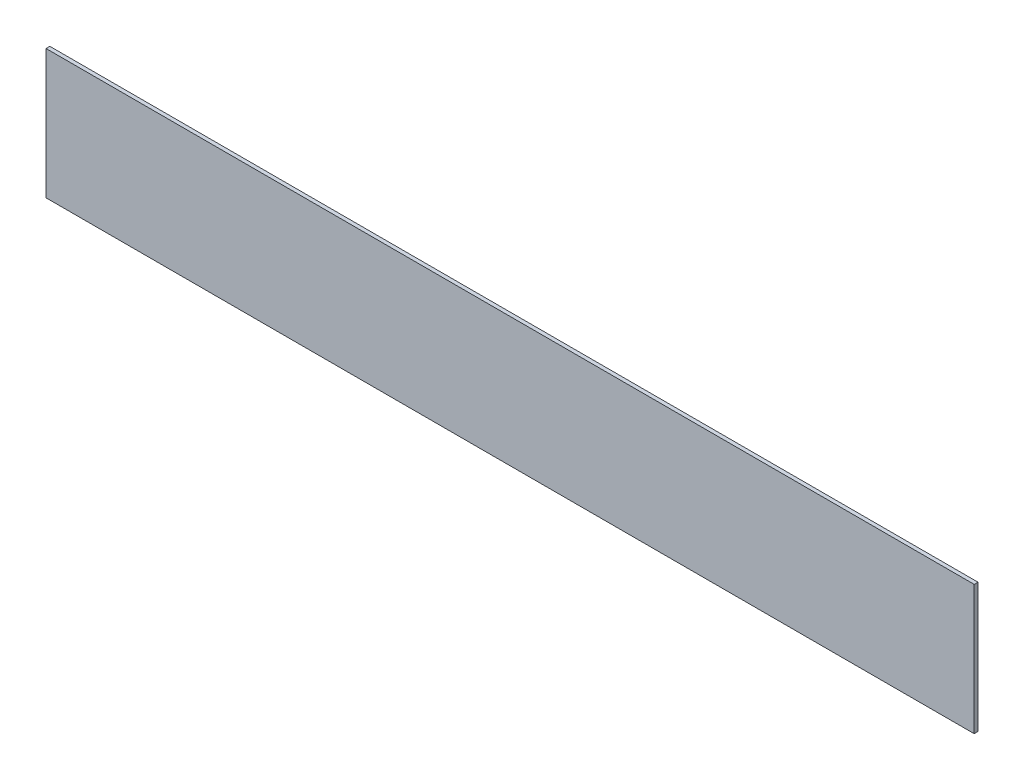
ISO-10303-21;
HEADER;
FILE_DESCRIPTION(('STEP AP214'),'2;1');
FILE_NAME('part.step','',(''),(''),'','','');
FILE_SCHEMA(('AUTOMOTIVE_DESIGN { 1 0 10303 214 1 1 1 1 }'));
ENDSEC;
DATA;
#1=APPLICATION_CONTEXT('core data for automotive mechanical design processes');
#2=APPLICATION_PROTOCOL_DEFINITION('international standard','automotive_design',2000,#1);
#3=PRODUCT_CONTEXT('',#1,'mechanical');
#4=PRODUCT('Part','Part','',(#3));
#5=PRODUCT_RELATED_PRODUCT_CATEGORY('part','',(#4));
#6=PRODUCT_DEFINITION_FORMATION('','',#4);
#7=PRODUCT_DEFINITION_CONTEXT('part definition',#1,'design');
#8=PRODUCT_DEFINITION('design','',#6,#7);
#9=PRODUCT_DEFINITION_SHAPE('','',#8);
#10=(LENGTH_UNIT() NAMED_UNIT(*) SI_UNIT(.MILLI.,.METRE.));
#11=(NAMED_UNIT(*) PLANE_ANGLE_UNIT() SI_UNIT($,.RADIAN.));
#12=(NAMED_UNIT(*) SI_UNIT($,.STERADIAN.) SOLID_ANGLE_UNIT());
#13=UNCERTAINTY_MEASURE_WITH_UNIT(LENGTH_MEASURE(1.E-05),#10,'distance_accuracy_value','');
#14=(GEOMETRIC_REPRESENTATION_CONTEXT(3) GLOBAL_UNCERTAINTY_ASSIGNED_CONTEXT((#13)) GLOBAL_UNIT_ASSIGNED_CONTEXT((#10,
#11,#12)) REPRESENTATION_CONTEXT('',''));
#15=CARTESIAN_POINT('',(0.,0.,0.));
#16=DIRECTION('',(0.,0.,1.));
#17=DIRECTION('',(1.,0.,0.));
#18=AXIS2_PLACEMENT_3D('',#15,#16,#17);
#19=CARTESIAN_POINT('',(61.,8.5,0.5));
#20=DIRECTION('',(-1.,0.,0.));
#21=DIRECTION('',(0.,0.,1.));
#22=AXIS2_PLACEMENT_3D('',#19,#20,#21);
#23=PLANE('',#22);
#24=DIRECTION('',(0.,1.,0.));
#25=VECTOR('',#24,1.);
#26=CARTESIAN_POINT('',(61.,8.5,0.));
#27=LINE('',#26,#25);
#28=CARTESIAN_POINT('',(61.,-8.5,0.));
#29=VERTEX_POINT('',#28);
#30=CARTESIAN_POINT('',(61.,8.5,0.));
#31=VERTEX_POINT('',#30);
#32=EDGE_CURVE('E95',#29,#31,#27,.T.);
#33=ORIENTED_EDGE('',*,*,#32,.T.);
#34=DIRECTION('',(0.,0.,-1.));
#35=VECTOR('',#34,1.);
#36=CARTESIAN_POINT('',(61.,8.5,0.5));
#37=LINE('',#36,#35);
#38=CARTESIAN_POINT('',(61.,8.5,0.5));
#39=VERTEX_POINT('',#38);
#40=EDGE_CURVE('E11',#39,#31,#37,.T.);
#41=ORIENTED_EDGE('',*,*,#40,.F.);
#42=DIRECTION('',(0.,1.,0.));
#43=VECTOR('',#42,1.);
#44=CARTESIAN_POINT('',(61.,8.5,0.5));
#45=LINE('',#44,#43);
#46=CARTESIAN_POINT('',(61.,-8.5,0.5));
#47=VERTEX_POINT('',#46);
#48=EDGE_CURVE('E83',#47,#39,#45,.T.);
#49=ORIENTED_EDGE('',*,*,#48,.F.);
#50=DIRECTION('',(0.,0.,-1.));
#51=VECTOR('',#50,1.);
#52=CARTESIAN_POINT('',(61.,-8.5,0.5));
#53=LINE('',#52,#51);
#54=EDGE_CURVE('E91',#47,#29,#53,.T.);
#55=ORIENTED_EDGE('',*,*,#54,.T.);
#56=EDGE_LOOP('',(#33,#41,#49,#55));
#57=FACE_BOUND('',#56,.T.);
#58=ADVANCED_FACE('F32',(#57),#23,.F.);
#59=CARTESIAN_POINT('',(-61.,8.5,0.5));
#60=DIRECTION('',(0.,-1.,0.));
#61=DIRECTION('',(0.,0.,-1.));
#62=AXIS2_PLACEMENT_3D('',#59,#60,#61);
#63=PLANE('',#62);
#64=DIRECTION('',(-1.,0.,0.));
#65=VECTOR('',#64,1.);
#66=CARTESIAN_POINT('',(-61.,8.5,0.));
#67=LINE('',#66,#65);
#68=CARTESIAN_POINT('',(-61.,8.5,0.));
#69=VERTEX_POINT('',#68);
#70=EDGE_CURVE('E87',#31,#69,#67,.T.);
#71=ORIENTED_EDGE('',*,*,#70,.T.);
#72=DIRECTION('',(0.,0.,-1.));
#73=VECTOR('',#72,1.);
#74=CARTESIAN_POINT('',(-61.,8.5,0.5));
#75=LINE('',#74,#73);
#76=CARTESIAN_POINT('',(-61.,8.5,0.5));
#77=VERTEX_POINT('',#76);
#78=EDGE_CURVE('E40',#77,#69,#75,.T.);
#79=ORIENTED_EDGE('',*,*,#78,.F.);
#80=DIRECTION('',(-1.,0.,0.));
#81=VECTOR('',#80,1.);
#82=CARTESIAN_POINT('',(-61.,8.5,0.5));
#83=LINE('',#82,#81);
#84=EDGE_CURVE('E78',#39,#77,#83,.T.);
#85=ORIENTED_EDGE('',*,*,#84,.F.);
#86=ORIENTED_EDGE('',*,*,#40,.T.);
#87=EDGE_LOOP('',(#71,#79,#85,#86));
#88=FACE_BOUND('',#87,.T.);
#89=ADVANCED_FACE('F86',(#88),#63,.F.);
#90=CARTESIAN_POINT('',(-61.,8.5,0.5));
#91=DIRECTION('',(1.,0.,0.));
#92=DIRECTION('',(0.,0.,-1.));
#93=AXIS2_PLACEMENT_3D('',#90,#91,#92);
#94=PLANE('',#93);
#95=DIRECTION('',(0.,-1.,0.));
#96=VECTOR('',#95,1.);
#97=CARTESIAN_POINT('',(-61.,8.5,0.));
#98=LINE('',#97,#96);
#99=CARTESIAN_POINT('',(-61.,-8.5,0.));
#100=VERTEX_POINT('',#99);
#101=EDGE_CURVE('E65',#69,#100,#98,.T.);
#102=ORIENTED_EDGE('',*,*,#101,.T.);
#103=DIRECTION('',(0.,0.,-1.));
#104=VECTOR('',#103,1.);
#105=CARTESIAN_POINT('',(-61.,-8.5,0.5));
#106=LINE('',#105,#104);
#107=CARTESIAN_POINT('',(-61.,-8.5,0.5));
#108=VERTEX_POINT('',#107);
#109=EDGE_CURVE('E88',#108,#100,#106,.T.);
#110=ORIENTED_EDGE('',*,*,#109,.F.);
#111=DIRECTION('',(0.,-1.,0.));
#112=VECTOR('',#111,1.);
#113=CARTESIAN_POINT('',(-61.,8.5,0.5));
#114=LINE('',#113,#112);
#115=EDGE_CURVE('E81',#77,#108,#114,.T.);
#116=ORIENTED_EDGE('',*,*,#115,.F.);
#117=ORIENTED_EDGE('',*,*,#78,.T.);
#118=EDGE_LOOP('',(#102,#110,#116,#117));
#119=FACE_BOUND('',#118,.T.);
#120=ADVANCED_FACE('F89',(#119),#94,.F.);
#121=CARTESIAN_POINT('',(-61.,-8.5,0.5));
#122=DIRECTION('',(0.,1.,0.));
#123=DIRECTION('',(0.,0.,1.));
#124=AXIS2_PLACEMENT_3D('',#121,#122,#123);
#125=PLANE('',#124);
#126=DIRECTION('',(1.,0.,0.));
#127=VECTOR('',#126,1.);
#128=CARTESIAN_POINT('',(-61.,-8.5,0.));
#129=LINE('',#128,#127);
#130=EDGE_CURVE('E71',#100,#29,#129,.T.);
#131=ORIENTED_EDGE('',*,*,#130,.T.);
#132=ORIENTED_EDGE('',*,*,#54,.F.);
#133=DIRECTION('',(1.,0.,0.));
#134=VECTOR('',#133,1.);
#135=CARTESIAN_POINT('',(-61.,-8.5,0.5));
#136=LINE('',#135,#134);
#137=EDGE_CURVE('E48',#108,#47,#136,.T.);
#138=ORIENTED_EDGE('',*,*,#137,.F.);
#139=ORIENTED_EDGE('',*,*,#109,.T.);
#140=EDGE_LOOP('',(#131,#132,#138,#139));
#141=FACE_BOUND('',#140,.T.);
#142=ADVANCED_FACE('F102',(#141),#125,.F.);
#143=CARTESIAN_POINT('',(0.,0.,0.5));
#144=DIRECTION('',(0.,0.,1.));
#145=DIRECTION('',(1.,0.,0.));
#146=AXIS2_PLACEMENT_3D('',#143,#144,#145);
#147=PLANE('',#146);
#148=ORIENTED_EDGE('',*,*,#48,.T.);
#149=ORIENTED_EDGE('',*,*,#84,.T.);
#150=ORIENTED_EDGE('',*,*,#115,.T.);
#151=ORIENTED_EDGE('',*,*,#137,.T.);
#152=EDGE_LOOP('',(#148,#149,#150,#151));
#153=FACE_BOUND('',#152,.T.);
#154=ADVANCED_FACE('F79',(#153),#147,.T.);
#155=CARTESIAN_POINT('',(0.,0.,0.));
#156=DIRECTION('',(0.,0.,1.));
#157=DIRECTION('',(1.,0.,0.));
#158=AXIS2_PLACEMENT_3D('',#155,#156,#157);
#159=PLANE('',#158);
#160=ORIENTED_EDGE('',*,*,#32,.F.);
#161=ORIENTED_EDGE('',*,*,#130,.F.);
#162=ORIENTED_EDGE('',*,*,#101,.F.);
#163=ORIENTED_EDGE('',*,*,#70,.F.);
#164=EDGE_LOOP('',(#160,#161,#162,#163));
#165=FACE_BOUND('',#164,.T.);
#166=ADVANCED_FACE('F105',(#165),#159,.F.);
#167=CLOSED_SHELL('',(#58,#89,#120,#142,#154,#166));
#168=MANIFOLD_SOLID_BREP('B2',#167);
#169=ADVANCED_BREP_SHAPE_REPRESENTATION('',(#18,#168),#14);
#170=SHAPE_DEFINITION_REPRESENTATION(#9,#169);
ENDSEC;
END-ISO-10303-21;
